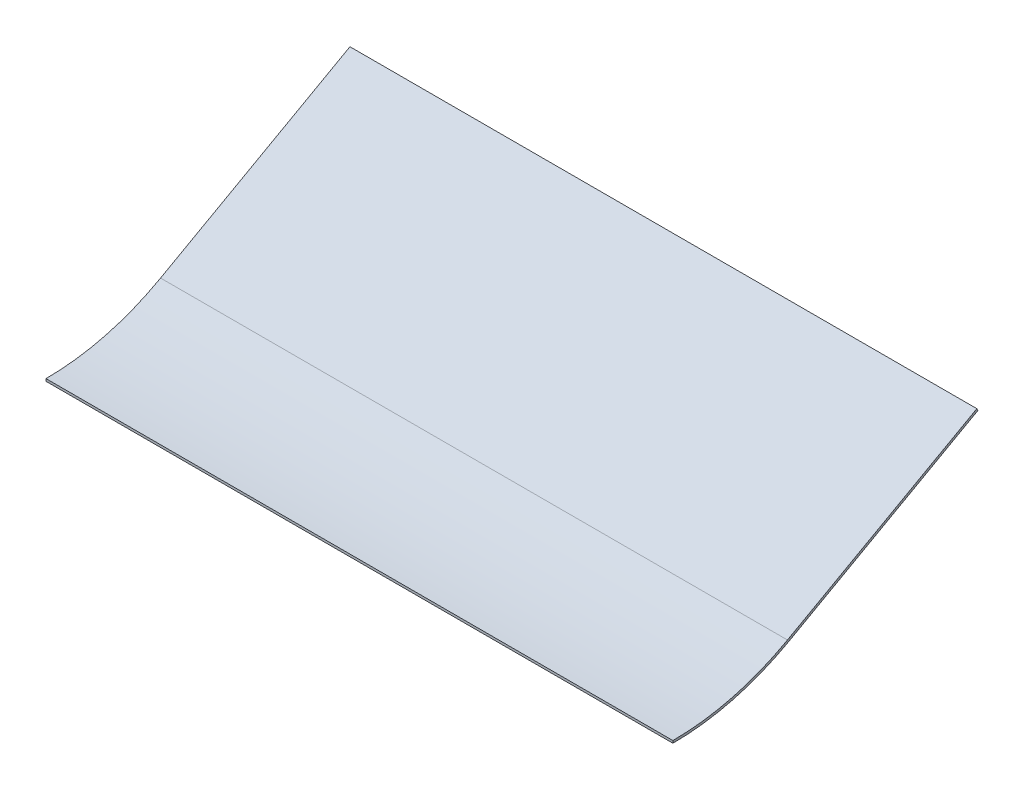
ISO-10303-21;
HEADER;
FILE_DESCRIPTION(('STEP AP214'),'2;1');
FILE_NAME('part.step','',(''),(''),'','','');
FILE_SCHEMA(('AUTOMOTIVE_DESIGN { 1 0 10303 214 1 1 1 1 }'));
ENDSEC;
DATA;
#1=APPLICATION_CONTEXT('core data for automotive mechanical design processes');
#2=APPLICATION_PROTOCOL_DEFINITION('international standard','automotive_design',2000,#1);
#3=PRODUCT_CONTEXT('',#1,'mechanical');
#4=PRODUCT('Part','Part','',(#3));
#5=PRODUCT_RELATED_PRODUCT_CATEGORY('part','',(#4));
#6=PRODUCT_DEFINITION_FORMATION('','',#4);
#7=PRODUCT_DEFINITION_CONTEXT('part definition',#1,'design');
#8=PRODUCT_DEFINITION('design','',#6,#7);
#9=PRODUCT_DEFINITION_SHAPE('','',#8);
#10=(LENGTH_UNIT() NAMED_UNIT(*) SI_UNIT(.MILLI.,.METRE.));
#11=(NAMED_UNIT(*) PLANE_ANGLE_UNIT() SI_UNIT($,.RADIAN.));
#12=(NAMED_UNIT(*) SI_UNIT($,.STERADIAN.) SOLID_ANGLE_UNIT());
#13=UNCERTAINTY_MEASURE_WITH_UNIT(LENGTH_MEASURE(1.E-05),#10,'distance_accuracy_value','');
#14=(GEOMETRIC_REPRESENTATION_CONTEXT(3) GLOBAL_UNCERTAINTY_ASSIGNED_CONTEXT((#13)) GLOBAL_UNIT_ASSIGNED_CONTEXT((#10,
#11,#12)) REPRESENTATION_CONTEXT('',''));
#15=CARTESIAN_POINT('',(0.,0.,0.));
#16=DIRECTION('',(0.,0.,1.));
#17=DIRECTION('',(1.,0.,0.));
#18=AXIS2_PLACEMENT_3D('',#15,#16,#17);
#19=CARTESIAN_POINT('',(419.1,-68.0739979426133,-203.973327904842));
#20=DIRECTION('',(0.,0.873326297204819,0.487135688089591));
#21=DIRECTION('',(0.,-0.487135688089591,0.87332629720482));
#22=AXIS2_PLACEMENT_3D('',#19,#20,#21);
#23=PLANE('',#22);
#24=DIRECTION('',(0.,0.487135688089591,-0.87332629720482));
#25=VECTOR('',#24,1.);
#26=CARTESIAN_POINT('',(0.,-68.0739979426133,-203.973327904842));
#27=LINE('',#26,#25);
#28=CARTESIAN_POINT('',(0.,-138.696005901138,-77.3637236004162));
#29=VERTEX_POINT('',#28);
#30=CARTESIAN_POINT('',(0.,-68.0739979426133,-203.973327904842));
#31=VERTEX_POINT('',#30);
#32=EDGE_CURVE('E114',#29,#31,#27,.T.);
#33=ORIENTED_EDGE('',*,*,#32,.T.);
#34=DIRECTION('',(-1.,0.,0.));
#35=VECTOR('',#34,1.);
#36=CARTESIAN_POINT('',(419.1,-68.0739979426133,-203.973327904842));
#37=LINE('',#36,#35);
#38=CARTESIAN_POINT('',(419.1,-68.0739979426133,-203.973327904842));
#39=VERTEX_POINT('',#38);
#40=EDGE_CURVE('E11',#39,#31,#37,.T.);
#41=ORIENTED_EDGE('',*,*,#40,.F.);
#42=DIRECTION('',(0.,0.487135688089591,-0.87332629720482));
#43=VECTOR('',#42,1.);
#44=CARTESIAN_POINT('',(419.1,-68.0739979426133,-203.973327904842));
#45=LINE('',#44,#43);
#46=CARTESIAN_POINT('',(419.1,-138.696005901138,-77.3637236004162));
#47=VERTEX_POINT('',#46);
#48=EDGE_CURVE('E79',#47,#39,#45,.T.);
#49=ORIENTED_EDGE('',*,*,#48,.F.);
#50=DIRECTION('',(-1.,0.,0.));
#51=VECTOR('',#50,1.);
#52=CARTESIAN_POINT('',(419.1,-138.696005901138,-77.3637236004162));
#53=LINE('',#52,#51);
#54=EDGE_CURVE('E110',#47,#29,#53,.T.);
#55=ORIENTED_EDGE('',*,*,#54,.T.);
#56=EDGE_LOOP('',(#33,#41,#49,#55));
#57=FACE_BOUND('',#56,.T.);
#58=ADVANCED_FACE('F33',(#57),#23,.F.);
#59=CARTESIAN_POINT('',(419.1,-66.6875924458006,-203.2));
#60=DIRECTION('',(0.,0.487135688089587,-0.873326297204822));
#61=DIRECTION('',(0.,0.873326297204822,0.487135688089587));
#62=AXIS2_PLACEMENT_3D('',#59,#60,#61);
#63=PLANE('',#62);
#64=DIRECTION('',(0.,-0.873326297204822,-0.487135688089587));
#65=VECTOR('',#64,1.);
#66=CARTESIAN_POINT('',(0.,-66.6875924458006,-203.2));
#67=LINE('',#66,#65);
#68=CARTESIAN_POINT('',(0.,-66.6875924458006,-203.2));
#69=VERTEX_POINT('',#68);
#70=EDGE_CURVE('E117',#69,#31,#67,.T.);
#71=ORIENTED_EDGE('',*,*,#70,.F.);
#72=DIRECTION('',(-1.,0.,0.));
#73=VECTOR('',#72,1.);
#74=CARTESIAN_POINT('',(419.1,-66.6875924458006,-203.2));
#75=LINE('',#74,#73);
#76=CARTESIAN_POINT('',(419.1,-66.6875924458006,-203.2));
#77=VERTEX_POINT('',#76);
#78=EDGE_CURVE('E41',#77,#69,#75,.T.);
#79=ORIENTED_EDGE('',*,*,#78,.F.);
#80=DIRECTION('',(0.,-0.873326297204822,-0.487135688089587));
#81=VECTOR('',#80,1.);
#82=CARTESIAN_POINT('',(419.1,-66.6875924458006,-203.2));
#83=LINE('',#82,#81);
#84=EDGE_CURVE('E203',#77,#39,#83,.T.);
#85=ORIENTED_EDGE('',*,*,#84,.T.);
#86=ORIENTED_EDGE('',*,*,#40,.T.);
#87=EDGE_LOOP('',(#71,#79,#85,#86));
#88=FACE_BOUND('',#87,.T.);
#89=ADVANCED_FACE('F135',(#88),#63,.T.);
#90=CARTESIAN_POINT('',(419.1,-66.6875924458006,-203.2));
#91=DIRECTION('',(0.,0.873326297204819,0.487135688089591));
#92=DIRECTION('',(0.,-0.487135688089591,0.87332629720482));
#93=AXIS2_PLACEMENT_3D('',#90,#91,#92);
#94=PLANE('',#93);
#95=DIRECTION('',(0.,0.487135688089591,-0.87332629720482));
#96=VECTOR('',#95,1.);
#97=CARTESIAN_POINT('',(0.,-66.6875924458006,-203.2));
#98=LINE('',#97,#96);
#99=CARTESIAN_POINT('',(0.,-137.309600404325,-76.590395695574));
#100=VERTEX_POINT('',#99);
#101=EDGE_CURVE('E120',#100,#69,#98,.T.);
#102=ORIENTED_EDGE('',*,*,#101,.F.);
#103=DIRECTION('',(-1.,0.,0.));
#104=VECTOR('',#103,1.);
#105=CARTESIAN_POINT('',(419.1,-137.309600404325,-76.590395695574));
#106=LINE('',#105,#104);
#107=CARTESIAN_POINT('',(419.1,-137.309600404325,-76.590395695574));
#108=VERTEX_POINT('',#107);
#109=EDGE_CURVE('E100',#108,#100,#106,.T.);
#110=ORIENTED_EDGE('',*,*,#109,.F.);
#111=DIRECTION('',(0.,0.487135688089591,-0.87332629720482));
#112=VECTOR('',#111,1.);
#113=CARTESIAN_POINT('',(419.1,-66.6875924458006,-203.2));
#114=LINE('',#113,#112);
#115=EDGE_CURVE('E106',#108,#77,#114,.T.);
#116=ORIENTED_EDGE('',*,*,#115,.T.);
#117=ORIENTED_EDGE('',*,*,#78,.T.);
#118=EDGE_LOOP('',(#102,#110,#116,#117));
#119=FACE_BOUND('',#118,.T.);
#120=ADVANCED_FACE('F132',(#119),#94,.T.);
#121=CARTESIAN_POINT('',(419.1,0.,0.));
#122=DIRECTION('',(-1.,0.,0.));
#123=DIRECTION('',(0.,0.,1.));
#124=AXIS2_PLACEMENT_3D('',#121,#122,#123);
#125=CYLINDRICAL_SURFACE('',#124,157.226);
#126=CARTESIAN_POINT('',(0.,0.,0.));
#127=DIRECTION('',(1.,0.,0.));
#128=DIRECTION('',(0.,0.,-1.));
#129=AXIS2_PLACEMENT_3D('',#126,#127,#128);
#130=CIRCLE('',#129,157.226);
#131=CARTESIAN_POINT('',(0.,-157.226,0.));
#132=VERTEX_POINT('',#131);
#133=EDGE_CURVE('E95',#132,#100,#130,.T.);
#134=ORIENTED_EDGE('',*,*,#133,.F.);
#135=DIRECTION('',(-1.,0.,0.));
#136=VECTOR('',#135,1.);
#137=CARTESIAN_POINT('',(419.1,-157.226,0.));
#138=LINE('',#137,#136);
#139=CARTESIAN_POINT('',(419.1,-157.226,0.));
#140=VERTEX_POINT('',#139);
#141=EDGE_CURVE('E90',#140,#132,#138,.T.);
#142=ORIENTED_EDGE('',*,*,#141,.F.);
#143=CARTESIAN_POINT('',(419.1,0.,0.));
#144=DIRECTION('',(1.,0.,0.));
#145=DIRECTION('',(0.,0.,-1.));
#146=AXIS2_PLACEMENT_3D('',#143,#144,#145);
#147=CIRCLE('',#146,157.226);
#148=EDGE_CURVE('E93',#140,#108,#147,.T.);
#149=ORIENTED_EDGE('',*,*,#148,.T.);
#150=ORIENTED_EDGE('',*,*,#109,.T.);
#151=EDGE_LOOP('',(#134,#142,#149,#150));
#152=FACE_BOUND('',#151,.T.);
#153=ADVANCED_FACE('F92',(#152),#125,.F.);
#154=CARTESIAN_POINT('',(419.1,-158.8135,0.));
#155=DIRECTION('',(0.,0.,1.));
#156=DIRECTION('',(0.,-1.,0.));
#157=AXIS2_PLACEMENT_3D('',#154,#155,#156);
#158=PLANE('',#157);
#159=DIRECTION('',(0.,1.,0.));
#160=VECTOR('',#159,1.);
#161=CARTESIAN_POINT('',(0.,-158.8135,0.));
#162=LINE('',#161,#160);
#163=CARTESIAN_POINT('',(0.,-158.8135,0.));
#164=VERTEX_POINT('',#163);
#165=EDGE_CURVE('E124',#164,#132,#162,.T.);
#166=ORIENTED_EDGE('',*,*,#165,.F.);
#167=DIRECTION('',(-1.,0.,0.));
#168=VECTOR('',#167,1.);
#169=CARTESIAN_POINT('',(419.1,-158.8135,0.));
#170=LINE('',#169,#168);
#171=CARTESIAN_POINT('',(419.1,-158.8135,0.));
#172=VERTEX_POINT('',#171);
#173=EDGE_CURVE('E70',#172,#164,#170,.T.);
#174=ORIENTED_EDGE('',*,*,#173,.F.);
#175=DIRECTION('',(0.,1.,0.));
#176=VECTOR('',#175,1.);
#177=CARTESIAN_POINT('',(419.1,-158.8135,0.));
#178=LINE('',#177,#176);
#179=EDGE_CURVE('E104',#172,#140,#178,.T.);
#180=ORIENTED_EDGE('',*,*,#179,.T.);
#181=ORIENTED_EDGE('',*,*,#141,.T.);
#182=EDGE_LOOP('',(#166,#174,#180,#181));
#183=FACE_BOUND('',#182,.T.);
#184=ADVANCED_FACE('F108',(#183),#158,.T.);
#185=CARTESIAN_POINT('',(419.1,0.,0.));
#186=DIRECTION('',(-1.,0.,0.));
#187=DIRECTION('',(0.,0.,1.));
#188=AXIS2_PLACEMENT_3D('',#185,#186,#187);
#189=CYLINDRICAL_SURFACE('',#188,158.8135);
#190=CARTESIAN_POINT('',(0.,0.,0.));
#191=DIRECTION('',(1.,0.,0.));
#192=DIRECTION('',(0.,0.,-1.));
#193=AXIS2_PLACEMENT_3D('',#190,#191,#192);
#194=CIRCLE('',#193,158.8135);
#195=EDGE_CURVE('E73',#164,#29,#194,.T.);
#196=ORIENTED_EDGE('',*,*,#195,.T.);
#197=ORIENTED_EDGE('',*,*,#54,.F.);
#198=CARTESIAN_POINT('',(419.1,0.,0.));
#199=DIRECTION('',(1.,0.,0.));
#200=DIRECTION('',(0.,0.,-1.));
#201=AXIS2_PLACEMENT_3D('',#198,#199,#200);
#202=CIRCLE('',#201,158.8135);
#203=EDGE_CURVE('E49',#172,#47,#202,.T.);
#204=ORIENTED_EDGE('',*,*,#203,.F.);
#205=ORIENTED_EDGE('',*,*,#173,.T.);
#206=EDGE_LOOP('',(#196,#197,#204,#205));
#207=FACE_BOUND('',#206,.T.);
#208=ADVANCED_FACE('F140',(#207),#189,.T.);
#209=CARTESIAN_POINT('',(419.1,0.,0.));
#210=DIRECTION('',(1.,0.,0.));
#211=DIRECTION('',(0.,0.,-1.));
#212=AXIS2_PLACEMENT_3D('',#209,#210,#211);
#213=PLANE('',#212);
#214=ORIENTED_EDGE('',*,*,#48,.T.);
#215=ORIENTED_EDGE('',*,*,#84,.F.);
#216=ORIENTED_EDGE('',*,*,#115,.F.);
#217=ORIENTED_EDGE('',*,*,#148,.F.);
#218=ORIENTED_EDGE('',*,*,#179,.F.);
#219=ORIENTED_EDGE('',*,*,#203,.T.);
#220=EDGE_LOOP('',(#214,#215,#216,#217,#218,#219));
#221=FACE_BOUND('',#220,.T.);
#222=ADVANCED_FACE('F103',(#221),#213,.T.);
#223=CARTESIAN_POINT('',(0.,0.,0.));
#224=DIRECTION('',(1.,0.,0.));
#225=DIRECTION('',(0.,0.,-1.));
#226=AXIS2_PLACEMENT_3D('',#223,#224,#225);
#227=PLANE('',#226);
#228=ORIENTED_EDGE('',*,*,#32,.F.);
#229=ORIENTED_EDGE('',*,*,#195,.F.);
#230=ORIENTED_EDGE('',*,*,#165,.T.);
#231=ORIENTED_EDGE('',*,*,#133,.T.);
#232=ORIENTED_EDGE('',*,*,#101,.T.);
#233=ORIENTED_EDGE('',*,*,#70,.T.);
#234=EDGE_LOOP('',(#228,#229,#230,#231,#232,#233));
#235=FACE_BOUND('',#234,.T.);
#236=ADVANCED_FACE('F138',(#235),#227,.F.);
#237=CLOSED_SHELL('',(#58,#89,#120,#153,#184,#208,#222,#236));
#238=MANIFOLD_SOLID_BREP('B2',#237);
#239=ADVANCED_BREP_SHAPE_REPRESENTATION('',(#18,#238),#14);
#240=SHAPE_DEFINITION_REPRESENTATION(#9,#239);
ENDSEC;
END-ISO-10303-21;
